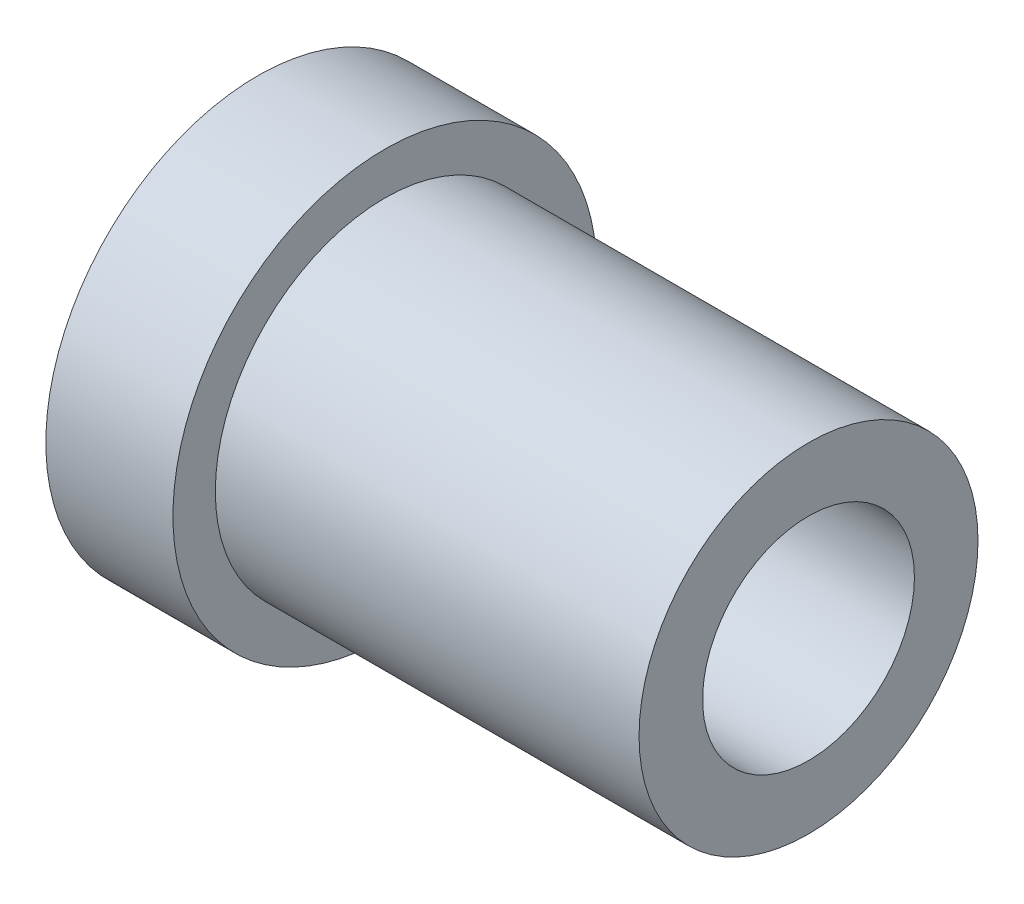
ISO-10303-21;
HEADER;
FILE_DESCRIPTION(('STEP AP214'),'2;1');
FILE_NAME('part.step','',(''),(''),'','','');
FILE_SCHEMA(('AUTOMOTIVE_DESIGN { 1 0 10303 214 1 1 1 1 }'));
ENDSEC;
DATA;
#1=APPLICATION_CONTEXT('core data for automotive mechanical design processes');
#2=APPLICATION_PROTOCOL_DEFINITION('international standard','automotive_design',2000,#1);
#3=PRODUCT_CONTEXT('',#1,'mechanical');
#4=PRODUCT('Part','Part','',(#3));
#5=PRODUCT_RELATED_PRODUCT_CATEGORY('part','',(#4));
#6=PRODUCT_DEFINITION_FORMATION('','',#4);
#7=PRODUCT_DEFINITION_CONTEXT('part definition',#1,'design');
#8=PRODUCT_DEFINITION('design','',#6,#7);
#9=PRODUCT_DEFINITION_SHAPE('','',#8);
#10=(LENGTH_UNIT() NAMED_UNIT(*) SI_UNIT(.MILLI.,.METRE.));
#11=(NAMED_UNIT(*) PLANE_ANGLE_UNIT() SI_UNIT($,.RADIAN.));
#12=(NAMED_UNIT(*) SI_UNIT($,.STERADIAN.) SOLID_ANGLE_UNIT());
#13=UNCERTAINTY_MEASURE_WITH_UNIT(LENGTH_MEASURE(1.E-05),#10,'distance_accuracy_value','');
#14=(GEOMETRIC_REPRESENTATION_CONTEXT(3) GLOBAL_UNCERTAINTY_ASSIGNED_CONTEXT((#13)) GLOBAL_UNIT_ASSIGNED_CONTEXT((#10,
#11,#12)) REPRESENTATION_CONTEXT('',''));
#15=CARTESIAN_POINT('',(0.,0.,0.));
#16=DIRECTION('',(0.,0.,1.));
#17=DIRECTION('',(1.,0.,0.));
#18=AXIS2_PLACEMENT_3D('',#15,#16,#17);
#19=CARTESIAN_POINT('',(0.,4.33012701892218,-2.5));
#20=DIRECTION('',(-1.,0.,0.));
#21=DIRECTION('',(0.,0.,1.00000000000001));
#22=AXIS2_PLACEMENT_3D('',#19,#20,#21);
#23=PLANE('',#22);
#24=CARTESIAN_POINT('',(0.,0.,0.));
#25=DIRECTION('',(-1.,0.,0.));
#26=DIRECTION('',(0.,0.,1.00000000000001));
#27=AXIS2_PLACEMENT_3D('',#24,#25,#26);
#28=CIRCLE('',#27,2.5);
#29=CARTESIAN_POINT('',(0.,0.,2.5));
#30=VERTEX_POINT('',#29);
#31=CARTESIAN_POINT('',(0.,2.1650635094611,1.25));
#32=VERTEX_POINT('',#31);
#33=EDGE_CURVE('E11',#30,#32,#28,.T.);
#34=ORIENTED_EDGE('',*,*,#33,.F.);
#35=DIRECTION('',(0.,1.,0.));
#36=VECTOR('',#35,1.);
#37=CARTESIAN_POINT('',(0.,-1.44337567297407,2.5));
#38=LINE('',#37,#36);
#39=CARTESIAN_POINT('',(0.,1.44337567297406,2.5));
#40=VERTEX_POINT('',#39);
#41=EDGE_CURVE('E112',#30,#40,#38,.T.);
#42=ORIENTED_EDGE('',*,*,#41,.T.);
#43=DIRECTION('',(0.,0.499999999999996,-0.866025403784441));
#44=VECTOR('',#43,1.);
#45=CARTESIAN_POINT('',(0.,1.44337567297406,2.5));
#46=LINE('',#45,#44);
#47=EDGE_CURVE('E115',#40,#32,#46,.T.);
#48=ORIENTED_EDGE('',*,*,#47,.T.);
#49=EDGE_LOOP('',(#34,#42,#48));
#50=FACE_BOUND('',#49,.T.);
#51=ADVANCED_FACE('F31',(#50),#23,.T.);
#52=CARTESIAN_POINT('',(0.,2.1650635094611,-1.25));
#53=VERTEX_POINT('',#52);
#54=EDGE_CURVE('E40',#32,#53,#28,.T.);
#55=ORIENTED_EDGE('',*,*,#54,.F.);
#56=CARTESIAN_POINT('',(0.,2.88675134594813,0.));
#57=VERTEX_POINT('',#56);
#58=EDGE_CURVE('E225',#32,#57,#46,.T.);
#59=ORIENTED_EDGE('',*,*,#58,.T.);
#60=DIRECTION('',(0.,-0.500000000000005,-0.866025403784447));
#61=VECTOR('',#60,1.);
#62=CARTESIAN_POINT('',(0.,2.88675134594813,0.));
#63=LINE('',#62,#61);
#64=EDGE_CURVE('E220',#57,#53,#63,.T.);
#65=ORIENTED_EDGE('',*,*,#64,.T.);
#66=EDGE_LOOP('',(#55,#59,#65));
#67=FACE_BOUND('',#66,.T.);
#68=ADVANCED_FACE('F174',(#67),#23,.T.);
#69=CARTESIAN_POINT('',(0.,0.,-2.5));
#70=VERTEX_POINT('',#69);
#71=EDGE_CURVE('E259',#53,#70,#28,.T.);
#72=ORIENTED_EDGE('',*,*,#71,.F.);
#73=CARTESIAN_POINT('',(0.,1.44337567297406,-2.50000000000002));
#74=VERTEX_POINT('',#73);
#75=EDGE_CURVE('E223',#53,#74,#63,.T.);
#76=ORIENTED_EDGE('',*,*,#75,.T.);
#77=DIRECTION('',(0.,-1.,0.));
#78=VECTOR('',#77,1.);
#79=CARTESIAN_POINT('',(0.,1.44337567297406,-2.50000000000002));
#80=LINE('',#79,#78);
#81=EDGE_CURVE('E212',#74,#70,#80,.T.);
#82=ORIENTED_EDGE('',*,*,#81,.T.);
#83=EDGE_LOOP('',(#72,#76,#82));
#84=FACE_BOUND('',#83,.T.);
#85=ADVANCED_FACE('F180',(#84),#23,.T.);
#86=CARTESIAN_POINT('',(0.,-2.16506350946109,-1.25000000000002));
#87=VERTEX_POINT('',#86);
#88=EDGE_CURVE('E206',#70,#87,#28,.T.);
#89=ORIENTED_EDGE('',*,*,#88,.F.);
#90=CARTESIAN_POINT('',(0.,-1.44337567297406,-2.5));
#91=VERTEX_POINT('',#90);
#92=EDGE_CURVE('E215',#70,#91,#80,.T.);
#93=ORIENTED_EDGE('',*,*,#92,.T.);
#94=DIRECTION('',(0.,-0.499999999999996,0.866025403784441));
#95=VECTOR('',#94,1.);
#96=CARTESIAN_POINT('',(0.,-1.44337567297406,-2.5));
#97=LINE('',#96,#95);
#98=EDGE_CURVE('E211',#91,#87,#97,.T.);
#99=ORIENTED_EDGE('',*,*,#98,.T.);
#100=EDGE_LOOP('',(#89,#93,#99));
#101=FACE_BOUND('',#100,.T.);
#102=ADVANCED_FACE('F194',(#101),#23,.T.);
#103=CARTESIAN_POINT('',(0.,-2.1650635094611,1.25));
#104=VERTEX_POINT('',#103);
#105=EDGE_CURVE('E47',#87,#104,#28,.T.);
#106=ORIENTED_EDGE('',*,*,#105,.F.);
#107=CARTESIAN_POINT('',(0.,-2.88675134594813,0.));
#108=VERTEX_POINT('',#107);
#109=EDGE_CURVE('E203',#87,#108,#97,.T.);
#110=ORIENTED_EDGE('',*,*,#109,.T.);
#111=DIRECTION('',(0.,0.500000000000005,0.866025403784446));
#112=VECTOR('',#111,1.);
#113=CARTESIAN_POINT('',(0.,-2.88675134594813,0.));
#114=LINE('',#113,#112);
#115=EDGE_CURVE('E122',#108,#104,#114,.T.);
#116=ORIENTED_EDGE('',*,*,#115,.T.);
#117=EDGE_LOOP('',(#106,#110,#116));
#118=FACE_BOUND('',#117,.T.);
#119=ADVANCED_FACE('F186',(#118),#23,.T.);
#120=CARTESIAN_POINT('',(9.99999999999999,0.,0.));
#121=DIRECTION('',(-1.,0.,0.));
#122=DIRECTION('',(0.,0.,1.00000000000001));
#123=AXIS2_PLACEMENT_3D('',#120,#121,#122);
#124=CYLINDRICAL_SURFACE('',#123,4.);
#125=CARTESIAN_POINT('',(0.,0.,0.));
#126=DIRECTION('',(1.,0.,0.));
#127=DIRECTION('',(0.,0.,-1.00000000000001));
#128=AXIS2_PLACEMENT_3D('',#125,#126,#127);
#129=CIRCLE('',#128,4.);
#130=CARTESIAN_POINT('',(0.,0.,-4.00000000000002));
#131=VERTEX_POINT('',#130);
#132=EDGE_CURVE('E150',#131,#131,#129,.T.);
#133=ORIENTED_EDGE('',*,*,#132,.T.);
#134=EDGE_LOOP('',(#133));
#135=FACE_BOUND('',#134,.T.);
#136=CARTESIAN_POINT('',(9.99999999999999,0.,0.));
#137=DIRECTION('',(1.,0.,0.));
#138=DIRECTION('',(0.,0.,-1.00000000000001));
#139=AXIS2_PLACEMENT_3D('',#136,#137,#138);
#140=CIRCLE('',#139,4.);
#141=CARTESIAN_POINT('',(9.99999999999999,0.,-4.00000000000002));
#142=VERTEX_POINT('',#141);
#143=EDGE_CURVE('E108',#142,#142,#140,.T.);
#144=ORIENTED_EDGE('',*,*,#143,.F.);
#145=EDGE_LOOP('',(#144));
#146=FACE_BOUND('',#145,.T.);
#147=ADVANCED_FACE('F33',(#135,#146),#124,.T.);
#148=CARTESIAN_POINT('',(9.99999999999999,0.,0.));
#149=DIRECTION('',(1.,0.,0.));
#150=DIRECTION('',(0.,0.,-1.00000000000001));
#151=AXIS2_PLACEMENT_3D('',#148,#149,#150);
#152=PLANE('',#151);
#153=CARTESIAN_POINT('',(9.99999999999999,0.,0.));
#154=DIRECTION('',(1.,0.,0.));
#155=DIRECTION('',(0.,0.,-1.00000000000001));
#156=AXIS2_PLACEMENT_3D('',#153,#154,#155);
#157=CIRCLE('',#156,2.5);
#158=CARTESIAN_POINT('',(9.99999999999999,0.,-2.50000000000002));
#159=VERTEX_POINT('',#158);
#160=EDGE_CURVE('E237',#159,#159,#157,.T.);
#161=ORIENTED_EDGE('',*,*,#160,.F.);
#162=EDGE_LOOP('',(#161));
#163=FACE_BOUND('',#162,.T.);
#164=ORIENTED_EDGE('',*,*,#143,.T.);
#165=EDGE_LOOP('',(#164));
#166=FACE_BOUND('',#165,.T.);
#167=ADVANCED_FACE('F160',(#163,#166),#152,.T.);
#168=CARTESIAN_POINT('',(0.,0.,0.));
#169=DIRECTION('',(1.,0.,0.));
#170=DIRECTION('',(0.,0.,-1.00000000000001));
#171=AXIS2_PLACEMENT_3D('',#168,#169,#170);
#172=PLANE('',#171);
#173=CARTESIAN_POINT('',(0.,0.,0.));
#174=DIRECTION('',(1.,0.,0.));
#175=DIRECTION('',(0.,0.,-1.00000000000001));
#176=AXIS2_PLACEMENT_3D('',#173,#174,#175);
#177=CIRCLE('',#176,5.);
#178=CARTESIAN_POINT('',(0.,0.,-5.00000000000003));
#179=VERTEX_POINT('',#178);
#180=EDGE_CURVE('E134',#179,#179,#177,.T.);
#181=ORIENTED_EDGE('',*,*,#180,.T.);
#182=EDGE_LOOP('',(#181));
#183=FACE_BOUND('',#182,.T.);
#184=ORIENTED_EDGE('',*,*,#132,.F.);
#185=EDGE_LOOP('',(#184));
#186=FACE_BOUND('',#185,.T.);
#187=ADVANCED_FACE('F157',(#183,#186),#172,.T.);
#188=CARTESIAN_POINT('',(-17.142135623731,0.,0.));
#189=DIRECTION('',(1.,0.,0.));
#190=DIRECTION('',(0.,0.,-1.00000000000001));
#191=AXIS2_PLACEMENT_3D('',#188,#189,#190);
#192=CYLINDRICAL_SURFACE('',#191,5.);
#193=CARTESIAN_POINT('',(-3.,0.,0.));
#194=DIRECTION('',(1.,0.,0.));
#195=DIRECTION('',(0.,0.,-1.00000000000001));
#196=AXIS2_PLACEMENT_3D('',#193,#194,#195);
#197=CIRCLE('',#196,5.);
#198=CARTESIAN_POINT('',(-3.,0.,-5.00000000000003));
#199=VERTEX_POINT('',#198);
#200=EDGE_CURVE('E147',#199,#199,#197,.F.);
#201=ORIENTED_EDGE('',*,*,#200,.F.);
#202=EDGE_LOOP('',(#201));
#203=FACE_BOUND('',#202,.T.);
#204=ORIENTED_EDGE('',*,*,#180,.F.);
#205=EDGE_LOOP('',(#204));
#206=FACE_BOUND('',#205,.T.);
#207=ADVANCED_FACE('F159',(#203,#206),#192,.T.);
#208=CARTESIAN_POINT('',(-3.,0.,0.));
#209=DIRECTION('',(1.,0.,0.));
#210=DIRECTION('',(0.,0.,-1.00000000000001));
#211=AXIS2_PLACEMENT_3D('',#208,#209,#210);
#212=PLANE('',#211);
#213=DIRECTION('',(0.,-0.500000000000005,-0.866025403784447));
#214=VECTOR('',#213,1.);
#215=CARTESIAN_POINT('',(-3.,2.88675134594815,0.));
#216=LINE('',#215,#214);
#217=CARTESIAN_POINT('',(-3.,2.88675134594815,0.));
#218=VERTEX_POINT('',#217);
#219=CARTESIAN_POINT('',(-3.,1.44337567297409,-2.50000000000005));
#220=VERTEX_POINT('',#219);
#221=EDGE_CURVE('E234',#218,#220,#216,.T.);
#222=ORIENTED_EDGE('',*,*,#221,.F.);
#223=DIRECTION('',(0.,0.499999999999996,-0.866025403784441));
#224=VECTOR('',#223,1.);
#225=CARTESIAN_POINT('',(-3.,1.44337567297411,2.49999999999995));
#226=LINE('',#225,#224);
#227=CARTESIAN_POINT('',(-3.,1.44337567297411,2.49999999999995));
#228=VERTEX_POINT('',#227);
#229=EDGE_CURVE('E55',#228,#218,#226,.T.);
#230=ORIENTED_EDGE('',*,*,#229,.F.);
#231=DIRECTION('',(0.,1.,0.));
#232=VECTOR('',#231,1.);
#233=CARTESIAN_POINT('',(-3.,-1.44337567297407,2.5));
#234=LINE('',#233,#232);
#235=CARTESIAN_POINT('',(-3.,-1.44337567297407,2.5));
#236=VERTEX_POINT('',#235);
#237=EDGE_CURVE('E226',#236,#228,#234,.T.);
#238=ORIENTED_EDGE('',*,*,#237,.F.);
#239=DIRECTION('',(0.,0.500000000000005,0.866025403784446));
#240=VECTOR('',#239,1.);
#241=CARTESIAN_POINT('',(-3.,-2.88675134594813,0.));
#242=LINE('',#241,#240);
#243=CARTESIAN_POINT('',(-3.,-2.88675134594813,0.));
#244=VERTEX_POINT('',#243);
#245=EDGE_CURVE('E228',#244,#236,#242,.T.);
#246=ORIENTED_EDGE('',*,*,#245,.F.);
#247=DIRECTION('',(0.,-0.499999999999996,0.866025403784441));
#248=VECTOR('',#247,1.);
#249=CARTESIAN_POINT('',(-3.,-1.44337567297405,-2.50000000000006));
#250=LINE('',#249,#248);
#251=CARTESIAN_POINT('',(-3.,-1.44337567297405,-2.50000000000006));
#252=VERTEX_POINT('',#251);
#253=EDGE_CURVE('E230',#252,#244,#250,.T.);
#254=ORIENTED_EDGE('',*,*,#253,.F.);
#255=DIRECTION('',(0.,-1.,0.));
#256=VECTOR('',#255,1.);
#257=CARTESIAN_POINT('',(-3.,1.44337567297409,-2.50000000000005));
#258=LINE('',#257,#256);
#259=EDGE_CURVE('E232',#220,#252,#258,.T.);
#260=ORIENTED_EDGE('',*,*,#259,.F.);
#261=EDGE_LOOP('',(#222,#230,#238,#246,#254,#260));
#262=FACE_BOUND('',#261,.T.);
#263=ORIENTED_EDGE('',*,*,#200,.T.);
#264=EDGE_LOOP('',(#263));
#265=FACE_BOUND('',#264,.T.);
#266=ADVANCED_FACE('F167',(#262,#265),#212,.F.);
#267=CARTESIAN_POINT('',(0.,1.44337567297406,2.5));
#268=DIRECTION('',(0.,0.866025403784442,0.500000000000008));
#269=DIRECTION('',(0.,-0.499999999999996,0.866025403784441));
#270=AXIS2_PLACEMENT_3D('',#267,#268,#269);
#271=PLANE('',#270);
#272=ORIENTED_EDGE('',*,*,#229,.T.);
#273=DIRECTION('',(-1.,0.,0.));
#274=VECTOR('',#273,1.);
#275=CARTESIAN_POINT('',(0.,2.88675134594813,0.));
#276=LINE('',#275,#274);
#277=EDGE_CURVE('E127',#57,#218,#276,.T.);
#278=ORIENTED_EDGE('',*,*,#277,.F.);
#279=ORIENTED_EDGE('',*,*,#58,.F.);
#280=ORIENTED_EDGE('',*,*,#47,.F.);
#281=DIRECTION('',(-1.,0.,0.));
#282=VECTOR('',#281,1.);
#283=CARTESIAN_POINT('',(0.,1.44337567297406,2.5));
#284=LINE('',#283,#282);
#285=EDGE_CURVE('E121',#40,#228,#284,.T.);
#286=ORIENTED_EDGE('',*,*,#285,.T.);
#287=EDGE_LOOP('',(#272,#278,#279,#280,#286));
#288=FACE_BOUND('',#287,.T.);
#289=ADVANCED_FACE('F256',(#288),#271,.F.);
#290=CARTESIAN_POINT('',(0.,-1.44337567297407,2.5));
#291=DIRECTION('',(0.,0.,1.00000000000001));
#292=DIRECTION('',(0.,-1.,0.));
#293=AXIS2_PLACEMENT_3D('',#290,#291,#292);
#294=PLANE('',#293);
#295=ORIENTED_EDGE('',*,*,#237,.T.);
#296=ORIENTED_EDGE('',*,*,#285,.F.);
#297=ORIENTED_EDGE('',*,*,#41,.F.);
#298=CARTESIAN_POINT('',(0.,-1.44337567297407,2.5));
#299=VERTEX_POINT('',#298);
#300=EDGE_CURVE('E120',#299,#30,#38,.T.);
#301=ORIENTED_EDGE('',*,*,#300,.F.);
#302=DIRECTION('',(-1.,0.,0.));
#303=VECTOR('',#302,1.);
#304=CARTESIAN_POINT('',(0.,-1.44337567297407,2.5));
#305=LINE('',#304,#303);
#306=EDGE_CURVE('E135',#299,#236,#305,.T.);
#307=ORIENTED_EDGE('',*,*,#306,.T.);
#308=EDGE_LOOP('',(#295,#296,#297,#301,#307));
#309=FACE_BOUND('',#308,.T.);
#310=ADVANCED_FACE('F118',(#309),#294,.F.);
#311=CARTESIAN_POINT('',(0.,-2.88675134594813,0.));
#312=DIRECTION('',(0.,-0.866025403784438,0.5));
#313=DIRECTION('',(0.,-0.500000000000005,-0.866025403784446));
#314=AXIS2_PLACEMENT_3D('',#311,#312,#313);
#315=PLANE('',#314);
#316=ORIENTED_EDGE('',*,*,#245,.T.);
#317=ORIENTED_EDGE('',*,*,#306,.F.);
#318=EDGE_CURVE('E125',#104,#299,#114,.T.);
#319=ORIENTED_EDGE('',*,*,#318,.F.);
#320=ORIENTED_EDGE('',*,*,#115,.F.);
#321=DIRECTION('',(-1.,0.,0.));
#322=VECTOR('',#321,1.);
#323=CARTESIAN_POINT('',(0.,-2.88675134594813,0.));
#324=LINE('',#323,#322);
#325=EDGE_CURVE('E137',#108,#244,#324,.T.);
#326=ORIENTED_EDGE('',*,*,#325,.T.);
#327=EDGE_LOOP('',(#316,#317,#319,#320,#326));
#328=FACE_BOUND('',#327,.T.);
#329=ADVANCED_FACE('F255',(#328),#315,.F.);
#330=CARTESIAN_POINT('',(0.,-1.44337567297406,-2.5));
#331=DIRECTION('',(0.,-0.866025403784443,-0.500000000000008));
#332=DIRECTION('',(0.,0.499999999999996,-0.866025403784441));
#333=AXIS2_PLACEMENT_3D('',#330,#331,#332);
#334=PLANE('',#333);
#335=ORIENTED_EDGE('',*,*,#253,.T.);
#336=ORIENTED_EDGE('',*,*,#325,.F.);
#337=ORIENTED_EDGE('',*,*,#109,.F.);
#338=ORIENTED_EDGE('',*,*,#98,.F.);
#339=DIRECTION('',(-1.,0.,0.));
#340=VECTOR('',#339,1.);
#341=CARTESIAN_POINT('',(0.,-1.44337567297406,-2.5));
#342=LINE('',#341,#340);
#343=EDGE_CURVE('E140',#91,#252,#342,.T.);
#344=ORIENTED_EDGE('',*,*,#343,.T.);
#345=EDGE_LOOP('',(#335,#336,#337,#338,#344));
#346=FACE_BOUND('',#345,.T.);
#347=ADVANCED_FACE('F210',(#346),#334,.F.);
#348=CARTESIAN_POINT('',(0.,1.44337567297406,-2.50000000000002));
#349=DIRECTION('',(0.,0.,-1.00000000000001));
#350=DIRECTION('',(-1.,0.,0.));
#351=AXIS2_PLACEMENT_3D('',#348,#349,#350);
#352=PLANE('',#351);
#353=ORIENTED_EDGE('',*,*,#259,.T.);
#354=ORIENTED_EDGE('',*,*,#343,.F.);
#355=ORIENTED_EDGE('',*,*,#92,.F.);
#356=ORIENTED_EDGE('',*,*,#81,.F.);
#357=DIRECTION('',(-1.,0.,0.));
#358=VECTOR('',#357,1.);
#359=CARTESIAN_POINT('',(0.,1.44337567297406,-2.50000000000002));
#360=LINE('',#359,#358);
#361=EDGE_CURVE('E128',#74,#220,#360,.T.);
#362=ORIENTED_EDGE('',*,*,#361,.T.);
#363=EDGE_LOOP('',(#353,#354,#355,#356,#362));
#364=FACE_BOUND('',#363,.T.);
#365=ADVANCED_FACE('F191',(#364),#352,.F.);
#366=CARTESIAN_POINT('',(0.,2.88675134594813,0.));
#367=DIRECTION('',(0.,0.866025403784438,-0.5));
#368=DIRECTION('',(0.,0.500000000000005,0.866025403784447));
#369=AXIS2_PLACEMENT_3D('',#366,#367,#368);
#370=PLANE('',#369);
#371=ORIENTED_EDGE('',*,*,#221,.T.);
#372=ORIENTED_EDGE('',*,*,#361,.F.);
#373=ORIENTED_EDGE('',*,*,#75,.F.);
#374=ORIENTED_EDGE('',*,*,#64,.F.);
#375=ORIENTED_EDGE('',*,*,#277,.T.);
#376=EDGE_LOOP('',(#371,#372,#373,#374,#375));
#377=FACE_BOUND('',#376,.T.);
#378=ADVANCED_FACE('F185',(#377),#370,.F.);
#379=EDGE_CURVE('E35',#104,#30,#28,.T.);
#380=ORIENTED_EDGE('',*,*,#379,.F.);
#381=ORIENTED_EDGE('',*,*,#318,.T.);
#382=ORIENTED_EDGE('',*,*,#300,.T.);
#383=EDGE_LOOP('',(#380,#381,#382));
#384=FACE_BOUND('',#383,.T.);
#385=ADVANCED_FACE('F124',(#384),#23,.T.);
#386=CARTESIAN_POINT('',(-3.,0.,0.));
#387=DIRECTION('',(1.,0.,0.));
#388=DIRECTION('',(0.,0.,-1.00000000000001));
#389=AXIS2_PLACEMENT_3D('',#386,#387,#388);
#390=CYLINDRICAL_SURFACE('',#389,2.5);
#391=ORIENTED_EDGE('',*,*,#33,.T.);
#392=ORIENTED_EDGE('',*,*,#54,.T.);
#393=ORIENTED_EDGE('',*,*,#71,.T.);
#394=ORIENTED_EDGE('',*,*,#88,.T.);
#395=ORIENTED_EDGE('',*,*,#105,.T.);
#396=ORIENTED_EDGE('',*,*,#379,.T.);
#397=EDGE_LOOP('',(#391,#392,#393,#394,#395,#396));
#398=FACE_BOUND('',#397,.T.);
#399=ORIENTED_EDGE('',*,*,#160,.T.);
#400=EDGE_LOOP('',(#399));
#401=FACE_BOUND('',#400,.T.);
#402=ADVANCED_FACE('F102',(#398,#401),#390,.F.);
#403=CLOSED_SHELL('',(#51,#68,#85,#102,#119,#147,#167,#187,#207,#266,#289,#310,#329,#347,#365,
#378,#385,#402));
#404=MANIFOLD_SOLID_BREP('B2',#403);
#405=ADVANCED_BREP_SHAPE_REPRESENTATION('',(#18,#404),#14);
#406=SHAPE_DEFINITION_REPRESENTATION(#9,#405);
ENDSEC;
END-ISO-10303-21;
